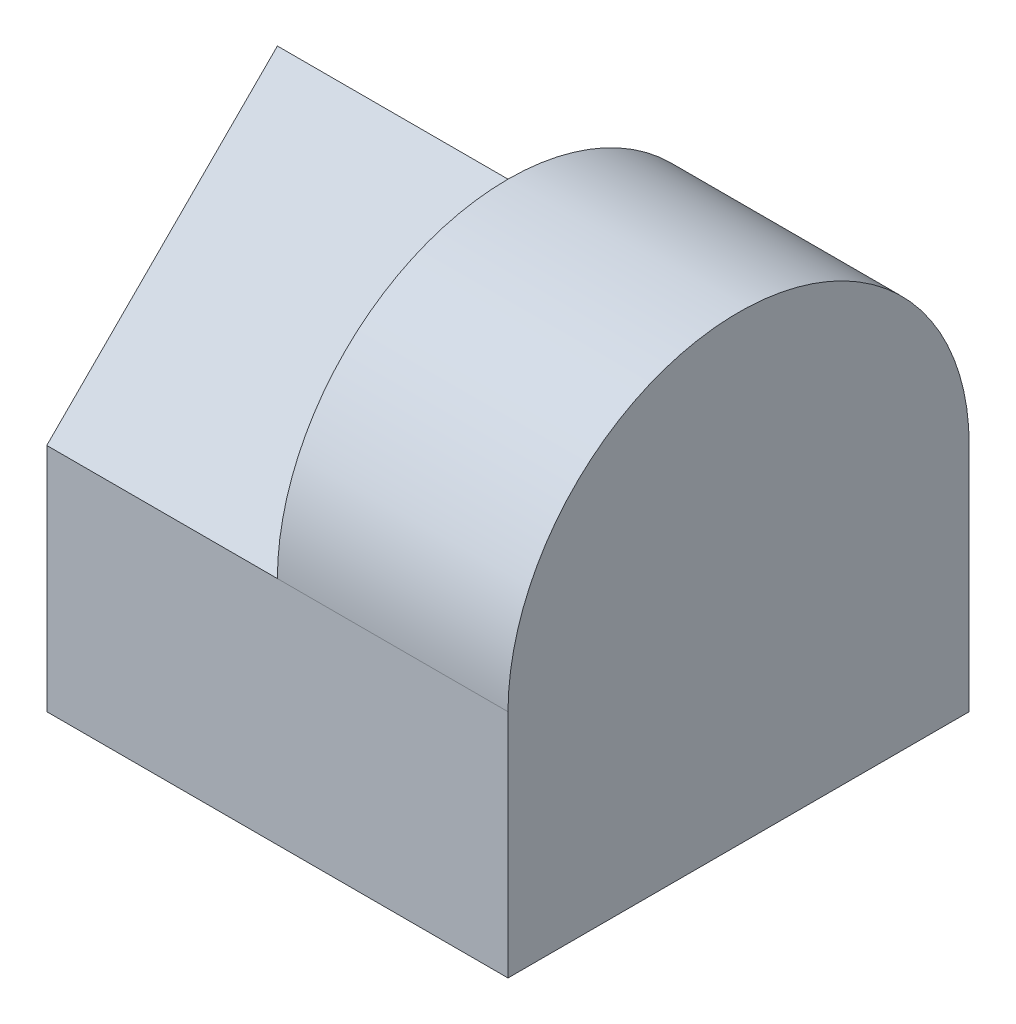
ISO-10303-21;
HEADER;
FILE_DESCRIPTION(('STEP AP214'),'2;1');
FILE_NAME('part.step','',(''),(''),'','','');
FILE_SCHEMA(('AUTOMOTIVE_DESIGN { 1 0 10303 214 1 1 1 1 }'));
ENDSEC;
DATA;
#1=APPLICATION_CONTEXT('core data for automotive mechanical design processes');
#2=APPLICATION_PROTOCOL_DEFINITION('international standard','automotive_design',2000,#1);
#3=PRODUCT_CONTEXT('',#1,'mechanical');
#4=PRODUCT('Part','Part','',(#3));
#5=PRODUCT_RELATED_PRODUCT_CATEGORY('part','',(#4));
#6=PRODUCT_DEFINITION_FORMATION('','',#4);
#7=PRODUCT_DEFINITION_CONTEXT('part definition',#1,'design');
#8=PRODUCT_DEFINITION('design','',#6,#7);
#9=PRODUCT_DEFINITION_SHAPE('','',#8);
#10=(LENGTH_UNIT() NAMED_UNIT(*) SI_UNIT(.MILLI.,.METRE.));
#11=(NAMED_UNIT(*) PLANE_ANGLE_UNIT() SI_UNIT($,.RADIAN.));
#12=(NAMED_UNIT(*) SI_UNIT($,.STERADIAN.) SOLID_ANGLE_UNIT());
#13=UNCERTAINTY_MEASURE_WITH_UNIT(LENGTH_MEASURE(1.E-05),#10,'distance_accuracy_value','');
#14=(GEOMETRIC_REPRESENTATION_CONTEXT(3) GLOBAL_UNCERTAINTY_ASSIGNED_CONTEXT((#13)) GLOBAL_UNIT_ASSIGNED_CONTEXT((#10,
#11,#12)) REPRESENTATION_CONTEXT('',''));
#15=CARTESIAN_POINT('',(0.,0.,0.));
#16=DIRECTION('',(0.,0.,1.));
#17=DIRECTION('',(1.,0.,0.));
#18=AXIS2_PLACEMENT_3D('',#15,#16,#17);
#19=CARTESIAN_POINT('',(2.,4.,2.));
#20=DIRECTION('',(-1.,0.,0.));
#21=DIRECTION('',(0.,0.,1.));
#22=AXIS2_PLACEMENT_3D('',#19,#20,#21);
#23=PLANE('',#22);
#24=CARTESIAN_POINT('',(2.,2.,0.));
#25=DIRECTION('',(-1.,0.,0.));
#26=DIRECTION('',(0.,0.,1.));
#27=AXIS2_PLACEMENT_3D('',#24,#25,#26);
#28=CIRCLE('',#27,2.);
#29=CARTESIAN_POINT('',(2.,2.,-2.));
#30=VERTEX_POINT('',#29);
#31=CARTESIAN_POINT('',(2.,2.,2.));
#32=VERTEX_POINT('',#31);
#33=EDGE_CURVE('E155',#30,#32,#28,.F.);
#34=ORIENTED_EDGE('',*,*,#33,.T.);
#35=DIRECTION('',(0.,-1.,0.));
#36=VECTOR('',#35,1.);
#37=CARTESIAN_POINT('',(2.,4.,2.));
#38=LINE('',#37,#36);
#39=CARTESIAN_POINT('',(2.,0.,2.));
#40=VERTEX_POINT('',#39);
#41=EDGE_CURVE('E49',#32,#40,#38,.T.);
#42=ORIENTED_EDGE('',*,*,#41,.T.);
#43=DIRECTION('',(0.,0.,-1.));
#44=VECTOR('',#43,1.);
#45=CARTESIAN_POINT('',(2.,0.,2.));
#46=LINE('',#45,#44);
#47=CARTESIAN_POINT('',(2.,0.,-2.));
#48=VERTEX_POINT('',#47);
#49=EDGE_CURVE('E126',#40,#48,#46,.T.);
#50=ORIENTED_EDGE('',*,*,#49,.T.);
#51=DIRECTION('',(0.,-1.,0.));
#52=VECTOR('',#51,1.);
#53=CARTESIAN_POINT('',(2.,4.,-2.));
#54=LINE('',#53,#52);
#55=EDGE_CURVE('E11',#30,#48,#54,.T.);
#56=ORIENTED_EDGE('',*,*,#55,.F.);
#57=EDGE_LOOP('',(#34,#42,#50,#56));
#58=FACE_BOUND('',#57,.T.);
#59=ADVANCED_FACE('F35',(#58),#23,.F.);
#60=CARTESIAN_POINT('',(-2.,4.,2.));
#61=DIRECTION('',(0.,0.,-1.));
#62=DIRECTION('',(-1.,0.,0.));
#63=AXIS2_PLACEMENT_3D('',#60,#61,#62);
#64=PLANE('',#63);
#65=DIRECTION('',(-1.,0.,0.));
#66=VECTOR('',#65,1.);
#67=CARTESIAN_POINT('',(10.,2.,2.));
#68=LINE('',#67,#66);
#69=CARTESIAN_POINT('',(0.,2.,2.));
#70=VERTEX_POINT('',#69);
#71=EDGE_CURVE('E95',#32,#70,#68,.T.);
#72=ORIENTED_EDGE('',*,*,#71,.T.);
#73=DIRECTION('',(-1.,0.,0.));
#74=VECTOR('',#73,1.);
#75=CARTESIAN_POINT('',(0.,2.,2.));
#76=LINE('',#75,#74);
#77=CARTESIAN_POINT('',(-2.,2.,2.));
#78=VERTEX_POINT('',#77);
#79=EDGE_CURVE('E112',#70,#78,#76,.T.);
#80=ORIENTED_EDGE('',*,*,#79,.T.);
#81=DIRECTION('',(0.,-1.,0.));
#82=VECTOR('',#81,1.);
#83=CARTESIAN_POINT('',(-2.,4.,2.));
#84=LINE('',#83,#82);
#85=CARTESIAN_POINT('',(-2.,0.,2.));
#86=VERTEX_POINT('',#85);
#87=EDGE_CURVE('E56',#78,#86,#84,.T.);
#88=ORIENTED_EDGE('',*,*,#87,.T.);
#89=DIRECTION('',(1.,0.,0.));
#90=VECTOR('',#89,1.);
#91=CARTESIAN_POINT('',(-2.,0.,2.));
#92=LINE('',#91,#90);
#93=EDGE_CURVE('E136',#86,#40,#92,.T.);
#94=ORIENTED_EDGE('',*,*,#93,.T.);
#95=ORIENTED_EDGE('',*,*,#41,.F.);
#96=EDGE_LOOP('',(#72,#80,#88,#94,#95));
#97=FACE_BOUND('',#96,.T.);
#98=ADVANCED_FACE('F151',(#97),#64,.F.);
#99=CARTESIAN_POINT('',(0.,0.,0.));
#100=DIRECTION('',(-1.,0.,0.));
#101=DIRECTION('',(0.,0.,1.));
#102=AXIS2_PLACEMENT_3D('',#99,#100,#101);
#103=PLANE('',#102);
#104=CARTESIAN_POINT('',(0.,2.,0.));
#105=DIRECTION('',(-1.,0.,0.));
#106=DIRECTION('',(0.,0.,1.));
#107=AXIS2_PLACEMENT_3D('',#104,#105,#106);
#108=CIRCLE('',#107,2.);
#109=CARTESIAN_POINT('',(0.,4.,0.));
#110=VERTEX_POINT('',#109);
#111=EDGE_CURVE('E87',#110,#70,#108,.F.);
#112=ORIENTED_EDGE('',*,*,#111,.F.);
#113=DIRECTION('',(0.,0.707106781186548,-0.707106781186548));
#114=VECTOR('',#113,1.);
#115=CARTESIAN_POINT('',(0.,2.,2.));
#116=LINE('',#115,#114);
#117=EDGE_CURVE('E91',#70,#110,#116,.T.);
#118=ORIENTED_EDGE('',*,*,#117,.F.);
#119=EDGE_LOOP('',(#112,#118));
#120=FACE_BOUND('',#119,.T.);
#121=ADVANCED_FACE('F89',(#120),#103,.T.);
#122=CARTESIAN_POINT('',(0.,0.,0.));
#123=DIRECTION('',(-1.,0.,0.));
#124=DIRECTION('',(0.,0.,1.));
#125=AXIS2_PLACEMENT_3D('',#122,#123,#124);
#126=PLANE('',#125);
#127=CARTESIAN_POINT('',(0.,2.,0.));
#128=DIRECTION('',(-1.,0.,0.));
#129=DIRECTION('',(0.,0.,1.));
#130=AXIS2_PLACEMENT_3D('',#127,#128,#129);
#131=CIRCLE('',#130,2.);
#132=CARTESIAN_POINT('',(0.,2.,-2.));
#133=VERTEX_POINT('',#132);
#134=EDGE_CURVE('E98',#133,#110,#131,.F.);
#135=ORIENTED_EDGE('',*,*,#134,.F.);
#136=DIRECTION('',(0.,-0.707106781186548,-0.707106781186548));
#137=VECTOR('',#136,1.);
#138=CARTESIAN_POINT('',(0.,2.,-2.));
#139=LINE('',#138,#137);
#140=EDGE_CURVE('E115',#110,#133,#139,.T.);
#141=ORIENTED_EDGE('',*,*,#140,.F.);
#142=EDGE_LOOP('',(#135,#141));
#143=FACE_BOUND('',#142,.T.);
#144=ADVANCED_FACE('F116',(#143),#126,.T.);
#145=CARTESIAN_POINT('',(-2.,4.,2.));
#146=DIRECTION('',(1.,0.,0.));
#147=DIRECTION('',(0.,0.,-1.));
#148=AXIS2_PLACEMENT_3D('',#145,#146,#147);
#149=PLANE('',#148);
#150=DIRECTION('',(0.,0.707106781186548,-0.707106781186548));
#151=VECTOR('',#150,1.);
#152=CARTESIAN_POINT('',(-2.,2.,2.));
#153=LINE('',#152,#151);
#154=CARTESIAN_POINT('',(-2.,4.,0.));
#155=VERTEX_POINT('',#154);
#156=EDGE_CURVE('E113',#78,#155,#153,.T.);
#157=ORIENTED_EDGE('',*,*,#156,.T.);
#158=DIRECTION('',(0.,-0.707106781186548,-0.707106781186548));
#159=VECTOR('',#158,1.);
#160=CARTESIAN_POINT('',(-2.,2.,-2.));
#161=LINE('',#160,#159);
#162=CARTESIAN_POINT('',(-2.,2.,-2.));
#163=VERTEX_POINT('',#162);
#164=EDGE_CURVE('E119',#155,#163,#161,.T.);
#165=ORIENTED_EDGE('',*,*,#164,.T.);
#166=DIRECTION('',(0.,-1.,0.));
#167=VECTOR('',#166,1.);
#168=CARTESIAN_POINT('',(-2.,4.,-2.));
#169=LINE('',#168,#167);
#170=CARTESIAN_POINT('',(-2.,0.,-2.));
#171=VERTEX_POINT('',#170);
#172=EDGE_CURVE('E42',#163,#171,#169,.T.);
#173=ORIENTED_EDGE('',*,*,#172,.T.);
#174=DIRECTION('',(0.,0.,1.));
#175=VECTOR('',#174,1.);
#176=CARTESIAN_POINT('',(-2.,0.,2.));
#177=LINE('',#176,#175);
#178=EDGE_CURVE('E134',#171,#86,#177,.T.);
#179=ORIENTED_EDGE('',*,*,#178,.T.);
#180=ORIENTED_EDGE('',*,*,#87,.F.);
#181=EDGE_LOOP('',(#157,#165,#173,#179,#180));
#182=FACE_BOUND('',#181,.T.);
#183=ADVANCED_FACE('F141',(#182),#149,.F.);
#184=CARTESIAN_POINT('',(-2.,4.,-2.));
#185=DIRECTION('',(0.,0.,1.));
#186=DIRECTION('',(1.,0.,0.));
#187=AXIS2_PLACEMENT_3D('',#184,#185,#186);
#188=PLANE('',#187);
#189=DIRECTION('',(-1.,0.,0.));
#190=VECTOR('',#189,1.);
#191=CARTESIAN_POINT('',(0.,2.,-2.));
#192=LINE('',#191,#190);
#193=EDGE_CURVE('E124',#133,#163,#192,.T.);
#194=ORIENTED_EDGE('',*,*,#193,.F.);
#195=DIRECTION('',(-1.,0.,0.));
#196=VECTOR('',#195,1.);
#197=CARTESIAN_POINT('',(10.,2.,-2.));
#198=LINE('',#197,#196);
#199=EDGE_CURVE('E101',#30,#133,#198,.T.);
#200=ORIENTED_EDGE('',*,*,#199,.F.);
#201=ORIENTED_EDGE('',*,*,#55,.T.);
#202=DIRECTION('',(-1.,0.,0.));
#203=VECTOR('',#202,1.);
#204=CARTESIAN_POINT('',(-2.,0.,-2.));
#205=LINE('',#204,#203);
#206=EDGE_CURVE('E131',#48,#171,#205,.T.);
#207=ORIENTED_EDGE('',*,*,#206,.T.);
#208=ORIENTED_EDGE('',*,*,#172,.F.);
#209=EDGE_LOOP('',(#194,#200,#201,#207,#208));
#210=FACE_BOUND('',#209,.T.);
#211=ADVANCED_FACE('F146',(#210),#188,.F.);
#212=CARTESIAN_POINT('',(0.,0.,0.));
#213=DIRECTION('',(0.,-1.,0.));
#214=DIRECTION('',(0.,0.,-1.));
#215=AXIS2_PLACEMENT_3D('',#212,#213,#214);
#216=PLANE('',#215);
#217=ORIENTED_EDGE('',*,*,#49,.F.);
#218=ORIENTED_EDGE('',*,*,#93,.F.);
#219=ORIENTED_EDGE('',*,*,#178,.F.);
#220=ORIENTED_EDGE('',*,*,#206,.F.);
#221=EDGE_LOOP('',(#217,#218,#219,#220));
#222=FACE_BOUND('',#221,.T.);
#223=ADVANCED_FACE('F150',(#222),#216,.T.);
#224=CARTESIAN_POINT('',(0.,2.,-2.));
#225=DIRECTION('',(0.,0.707106781186547,-0.707106781186547));
#226=DIRECTION('',(0.,0.707106781186548,0.707106781186548));
#227=AXIS2_PLACEMENT_3D('',#224,#225,#226);
#228=PLANE('',#227);
#229=ORIENTED_EDGE('',*,*,#164,.F.);
#230=DIRECTION('',(-1.,0.,0.));
#231=VECTOR('',#230,1.);
#232=CARTESIAN_POINT('',(0.,4.,0.));
#233=LINE('',#232,#231);
#234=EDGE_CURVE('E110',#110,#155,#233,.T.);
#235=ORIENTED_EDGE('',*,*,#234,.F.);
#236=ORIENTED_EDGE('',*,*,#140,.T.);
#237=ORIENTED_EDGE('',*,*,#193,.T.);
#238=EDGE_LOOP('',(#229,#235,#236,#237));
#239=FACE_BOUND('',#238,.T.);
#240=ADVANCED_FACE('F122',(#239),#228,.T.);
#241=CARTESIAN_POINT('',(0.,2.,2.));
#242=DIRECTION('',(0.,0.707106781186547,0.707106781186547));
#243=DIRECTION('',(0.,-0.707106781186548,0.707106781186548));
#244=AXIS2_PLACEMENT_3D('',#241,#242,#243);
#245=PLANE('',#244);
#246=ORIENTED_EDGE('',*,*,#156,.F.);
#247=ORIENTED_EDGE('',*,*,#79,.F.);
#248=ORIENTED_EDGE('',*,*,#117,.T.);
#249=ORIENTED_EDGE('',*,*,#234,.T.);
#250=EDGE_LOOP('',(#246,#247,#248,#249));
#251=FACE_BOUND('',#250,.T.);
#252=ADVANCED_FACE('F108',(#251),#245,.T.);
#253=CARTESIAN_POINT('',(10.,2.,0.));
#254=DIRECTION('',(-1.,0.,0.));
#255=DIRECTION('',(0.,0.,1.));
#256=AXIS2_PLACEMENT_3D('',#253,#254,#255);
#257=CYLINDRICAL_SURFACE('',#256,2.);
#258=ORIENTED_EDGE('',*,*,#199,.T.);
#259=ORIENTED_EDGE('',*,*,#134,.T.);
#260=ORIENTED_EDGE('',*,*,#111,.T.);
#261=ORIENTED_EDGE('',*,*,#71,.F.);
#262=ORIENTED_EDGE('',*,*,#33,.F.);
#263=EDGE_LOOP('',(#258,#259,#260,#261,#262));
#264=FACE_BOUND('',#263,.T.);
#265=ADVANCED_FACE('F99',(#264),#257,.T.);
#266=CLOSED_SHELL('',(#59,#98,#121,#144,#183,#211,#223,#240,#252,#265));
#267=MANIFOLD_SOLID_BREP('B2',#266);
#268=ADVANCED_BREP_SHAPE_REPRESENTATION('',(#18,#267),#14);
#269=SHAPE_DEFINITION_REPRESENTATION(#9,#268);
ENDSEC;
END-ISO-10303-21;
